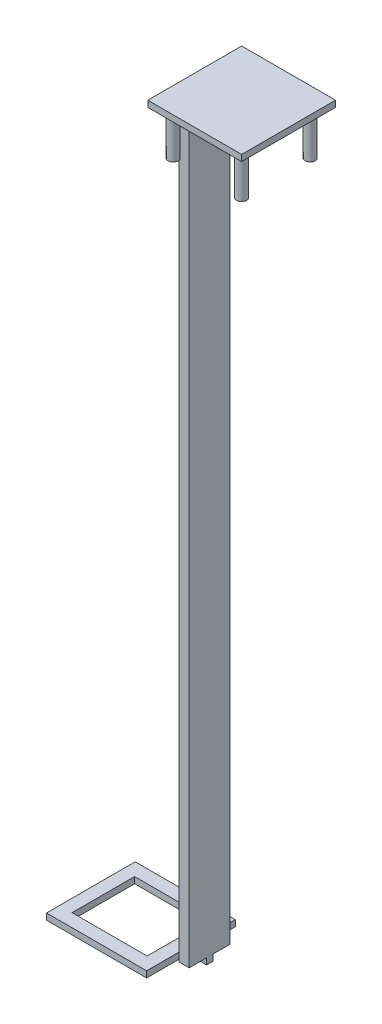
ISO-10303-21;
HEADER;
FILE_DESCRIPTION(('STEP AP214'),'2;1');
FILE_NAME('part.step','',(''),(''),'','','');
FILE_SCHEMA(('AUTOMOTIVE_DESIGN { 1 0 10303 214 1 1 1 1 }'));
ENDSEC;
DATA;
#1=APPLICATION_CONTEXT('core data for automotive mechanical design processes');
#2=APPLICATION_PROTOCOL_DEFINITION('international standard','automotive_design',2000,#1);
#3=PRODUCT_CONTEXT('',#1,'mechanical');
#4=PRODUCT('Part','Part','',(#3));
#5=PRODUCT_RELATED_PRODUCT_CATEGORY('part','',(#4));
#6=PRODUCT_DEFINITION_FORMATION('','',#4);
#7=PRODUCT_DEFINITION_CONTEXT('part definition',#1,'design');
#8=PRODUCT_DEFINITION('design','',#6,#7);
#9=PRODUCT_DEFINITION_SHAPE('','',#8);
#10=(LENGTH_UNIT() NAMED_UNIT(*) SI_UNIT(.MILLI.,.METRE.));
#11=(NAMED_UNIT(*) PLANE_ANGLE_UNIT() SI_UNIT($,.RADIAN.));
#12=(NAMED_UNIT(*) SI_UNIT($,.STERADIAN.) SOLID_ANGLE_UNIT());
#13=UNCERTAINTY_MEASURE_WITH_UNIT(LENGTH_MEASURE(1.E-05),#10,'distance_accuracy_value','');
#14=(GEOMETRIC_REPRESENTATION_CONTEXT(3) GLOBAL_UNCERTAINTY_ASSIGNED_CONTEXT((#13)) GLOBAL_UNIT_ASSIGNED_CONTEXT((#10,
#11,#12)) REPRESENTATION_CONTEXT('',''));
#15=CARTESIAN_POINT('',(0.,0.,0.));
#16=DIRECTION('',(0.,0.,1.));
#17=DIRECTION('',(1.,0.,0.));
#18=AXIS2_PLACEMENT_3D('',#15,#16,#17);
#19=CARTESIAN_POINT('',(0.,0.,0.));
#20=DIRECTION('',(0.,-1.,0.));
#21=DIRECTION('',(0.,0.,-1.));
#22=AXIS2_PLACEMENT_3D('',#19,#20,#21);
#23=PLANE('',#22);
#24=DIRECTION('',(-1.,0.,0.));
#25=VECTOR('',#24,1.);
#26=CARTESIAN_POINT('',(2.17170000004307,0.,-3.52939349999992));
#27=LINE('',#26,#25);
#28=CARTESIAN_POINT('',(2.17170000004307,0.,-3.52939349999992));
#29=VERTEX_POINT('',#28);
#30=CARTESIAN_POINT('',(-0.876299999956932,0.,-3.52939349999992));
#31=VERTEX_POINT('',#30);
#32=EDGE_CURVE('E297',#29,#31,#27,.T.);
#33=ORIENTED_EDGE('',*,*,#32,.F.);
#34=DIRECTION('',(0.,0.,-1.));
#35=VECTOR('',#34,1.);
#36=CARTESIAN_POINT('',(2.17170000004307,0.,-8.32878699999992));
#37=LINE('',#36,#35);
#38=CARTESIAN_POINT('',(2.17170000004307,0.,0.));
#39=VERTEX_POINT('',#38);
#40=EDGE_CURVE('E449',#39,#29,#37,.T.);
#41=ORIENTED_EDGE('',*,*,#40,.F.);
#42=DIRECTION('',(1.,0.,0.));
#43=VECTOR('',#42,1.);
#44=CARTESIAN_POINT('',(2.17170000004307,0.,0.));
#45=LINE('',#44,#43);
#46=CARTESIAN_POINT('',(0.139700000043068,0.,0.));
#47=VERTEX_POINT('',#46);
#48=EDGE_CURVE('E445',#47,#39,#45,.T.);
#49=ORIENTED_EDGE('',*,*,#48,.F.);
#50=DIRECTION('',(0.,0.,1.));
#51=VECTOR('',#50,1.);
#52=CARTESIAN_POINT('',(0.139700000043068,0.,0.));
#53=LINE('',#52,#51);
#54=CARTESIAN_POINT('',(0.139700000043068,0.,-1.30530599999992));
#55=VERTEX_POINT('',#54);
#56=EDGE_CURVE('E442',#55,#47,#53,.T.);
#57=ORIENTED_EDGE('',*,*,#56,.F.);
#58=DIRECTION('',(1.,0.,0.));
#59=VECTOR('',#58,1.);
#60=CARTESIAN_POINT('',(0.139700000043068,0.,-1.30530599999992));
#61=LINE('',#60,#59);
#62=CARTESIAN_POINT('',(-0.876299999956932,0.,-1.30530599999992));
#63=VERTEX_POINT('',#62);
#64=EDGE_CURVE('E438',#63,#55,#61,.T.);
#65=ORIENTED_EDGE('',*,*,#64,.F.);
#66=DIRECTION('',(0.,0.,1.));
#67=VECTOR('',#66,1.);
#68=CARTESIAN_POINT('',(-0.876299999956932,0.,-1.30530599999992));
#69=LINE('',#68,#67);
#70=EDGE_CURVE('E433',#31,#63,#69,.T.);
#71=ORIENTED_EDGE('',*,*,#70,.F.);
#72=EDGE_LOOP('',(#33,#41,#49,#57,#65,#71));
#73=FACE_BOUND('',#72,.T.);
#74=ADVANCED_FACE('F39',(#73),#23,.T.);
#75=CARTESIAN_POINT('',(0.139700000043068,152.4,-7.02348099999992));
#76=DIRECTION('',(1.,0.,0.));
#77=DIRECTION('',(0.,0.,-1.));
#78=AXIS2_PLACEMENT_3D('',#75,#76,#77);
#79=PLANE('',#78);
#80=DIRECTION('',(0.,0.,1.));
#81=VECTOR('',#80,1.);
#82=CARTESIAN_POINT('',(0.139700000043068,0.,-7.02348099999992));
#83=LINE('',#82,#81);
#84=CARTESIAN_POINT('',(0.139700000043068,0.,-8.32878699999992));
#85=VERTEX_POINT('',#84);
#86=CARTESIAN_POINT('',(0.139700000043068,0.,-7.02348099999992));
#87=VERTEX_POINT('',#86);
#88=EDGE_CURVE('E396',#85,#87,#83,.T.);
#89=ORIENTED_EDGE('',*,*,#88,.T.);
#90=DIRECTION('',(0.,-1.,0.));
#91=VECTOR('',#90,1.);
#92=CARTESIAN_POINT('',(0.139700000043068,152.4,-7.02348099999992));
#93=LINE('',#92,#91);
#94=CARTESIAN_POINT('',(0.139700000043068,152.4,-7.02348099999992));
#95=VERTEX_POINT('',#94);
#96=EDGE_CURVE('E482',#95,#87,#93,.T.);
#97=ORIENTED_EDGE('',*,*,#96,.F.);
#98=DIRECTION('',(0.,0.,1.));
#99=VECTOR('',#98,1.);
#100=CARTESIAN_POINT('',(0.139700000043068,152.4,-7.02348099999992));
#101=LINE('',#100,#99);
#102=CARTESIAN_POINT('',(0.139700000043068,152.4,-8.32878699999992));
#103=VERTEX_POINT('',#102);
#104=EDGE_CURVE('E397',#103,#95,#101,.T.);
#105=ORIENTED_EDGE('',*,*,#104,.F.);
#106=DIRECTION('',(0.,-1.,0.));
#107=VECTOR('',#106,1.);
#108=CARTESIAN_POINT('',(0.139700000043068,152.4,-8.32878699999992));
#109=LINE('',#108,#107);
#110=EDGE_CURVE('E426',#103,#85,#109,.T.);
#111=ORIENTED_EDGE('',*,*,#110,.T.);
#112=EDGE_LOOP('',(#89,#97,#105,#111));
#113=FACE_BOUND('',#112,.T.);
#114=ADVANCED_FACE('F41',(#113),#79,.F.);
#115=CARTESIAN_POINT('',(0.139700000043068,152.4,-7.02348099999992));
#116=DIRECTION('',(0.,0.,1.));
#117=DIRECTION('',(1.,0.,0.));
#118=AXIS2_PLACEMENT_3D('',#115,#116,#117);
#119=PLANE('',#118);
#120=DIRECTION('',(-1.,0.,0.));
#121=VECTOR('',#120,1.);
#122=CARTESIAN_POINT('',(0.139700000043068,0.,-7.02348099999992));
#123=LINE('',#122,#121);
#124=CARTESIAN_POINT('',(-0.876299999956932,0.,-7.02348099999992));
#125=VERTEX_POINT('',#124);
#126=EDGE_CURVE('E430',#87,#125,#123,.T.);
#127=ORIENTED_EDGE('',*,*,#126,.T.);
#128=DIRECTION('',(0.,-1.,0.));
#129=VECTOR('',#128,1.);
#130=CARTESIAN_POINT('',(-0.876299999956932,152.4,-7.02348099999992));
#131=LINE('',#130,#129);
#132=CARTESIAN_POINT('',(-0.876299999956932,152.4,-7.02348099999992));
#133=VERTEX_POINT('',#132);
#134=EDGE_CURVE('E478',#133,#125,#131,.T.);
#135=ORIENTED_EDGE('',*,*,#134,.F.);
#136=DIRECTION('',(-1.,0.,0.));
#137=VECTOR('',#136,1.);
#138=CARTESIAN_POINT('',(0.139700000043068,152.4,-7.02348099999992));
#139=LINE('',#138,#137);
#140=EDGE_CURVE('E401',#95,#133,#139,.T.);
#141=ORIENTED_EDGE('',*,*,#140,.F.);
#142=ORIENTED_EDGE('',*,*,#96,.T.);
#143=EDGE_LOOP('',(#127,#135,#141,#142));
#144=FACE_BOUND('',#143,.T.);
#145=ADVANCED_FACE('F527',(#144),#119,.F.);
#146=CARTESIAN_POINT('',(-0.876299999956932,152.4,-1.30530599999992));
#147=DIRECTION('',(1.,0.,0.));
#148=DIRECTION('',(0.,0.,-1.));
#149=AXIS2_PLACEMENT_3D('',#146,#147,#148);
#150=PLANE('',#149);
#151=CARTESIAN_POINT('',(-0.876299999956932,0.,-4.79939349999992));
#152=VERTEX_POINT('',#151);
#153=EDGE_CURVE('E434',#125,#152,#69,.T.);
#154=ORIENTED_EDGE('',*,*,#153,.T.);
#155=EDGE_CURVE('E439',#152,#31,#69,.T.);
#156=ORIENTED_EDGE('',*,*,#155,.T.);
#157=ORIENTED_EDGE('',*,*,#70,.T.);
#158=DIRECTION('',(0.,-1.,0.));
#159=VECTOR('',#158,1.);
#160=CARTESIAN_POINT('',(-0.876299999956932,152.4,-1.30530599999992));
#161=LINE('',#160,#159);
#162=CARTESIAN_POINT('',(-0.876299999956932,152.4,-1.30530599999992));
#163=VERTEX_POINT('',#162);
#164=EDGE_CURVE('E474',#163,#63,#161,.T.);
#165=ORIENTED_EDGE('',*,*,#164,.F.);
#166=DIRECTION('',(0.,0.,1.));
#167=VECTOR('',#166,1.);
#168=CARTESIAN_POINT('',(-0.876299999956933,152.4,-13.6893934999999));
#169=LINE('',#168,#167);
#170=CARTESIAN_POINT('',(-0.876299999956932,152.4,5.36060650000008));
#171=VERTEX_POINT('',#170);
#172=EDGE_CURVE('E353',#163,#171,#169,.T.);
#173=ORIENTED_EDGE('',*,*,#172,.T.);
#174=DIRECTION('',(0.,-1.,0.));
#175=VECTOR('',#174,1.);
#176=CARTESIAN_POINT('',(-0.876299999956932,153.67,5.36060650000008));
#177=LINE('',#176,#175);
#178=CARTESIAN_POINT('',(-0.876299999956932,153.67,5.36060650000008));
#179=VERTEX_POINT('',#178);
#180=EDGE_CURVE('E392',#179,#171,#177,.T.);
#181=ORIENTED_EDGE('',*,*,#180,.F.);
#182=DIRECTION('',(0.,0.,1.));
#183=VECTOR('',#182,1.);
#184=CARTESIAN_POINT('',(-0.876299999956933,153.67,-13.6893934999999));
#185=LINE('',#184,#183);
#186=CARTESIAN_POINT('',(-0.876299999956933,153.67,-13.6893934999999));
#187=VERTEX_POINT('',#186);
#188=EDGE_CURVE('E354',#187,#179,#185,.T.);
#189=ORIENTED_EDGE('',*,*,#188,.F.);
#190=DIRECTION('',(0.,-1.,0.));
#191=VECTOR('',#190,1.);
#192=CARTESIAN_POINT('',(-0.876299999956933,153.67,-13.6893934999999));
#193=LINE('',#192,#191);
#194=CARTESIAN_POINT('',(-0.876299999956933,152.4,-13.6893934999999));
#195=VERTEX_POINT('',#194);
#196=EDGE_CURVE('E368',#187,#195,#193,.T.);
#197=ORIENTED_EDGE('',*,*,#196,.T.);
#198=EDGE_CURVE('E369',#195,#133,#169,.T.);
#199=ORIENTED_EDGE('',*,*,#198,.T.);
#200=ORIENTED_EDGE('',*,*,#134,.T.);
#201=EDGE_LOOP('',(#154,#156,#157,#165,#173,#181,#189,#197,#199,#200));
#202=FACE_BOUND('',#201,.T.);
#203=ADVANCED_FACE('F529',(#202),#150,.F.);
#204=CARTESIAN_POINT('',(0.139700000043068,152.4,-1.30530599999992));
#205=DIRECTION('',(0.,0.,-1.));
#206=DIRECTION('',(-1.,0.,0.));
#207=AXIS2_PLACEMENT_3D('',#204,#205,#206);
#208=PLANE('',#207);
#209=ORIENTED_EDGE('',*,*,#64,.T.);
#210=DIRECTION('',(0.,-1.,0.));
#211=VECTOR('',#210,1.);
#212=CARTESIAN_POINT('',(0.139700000043068,152.4,-1.30530599999992));
#213=LINE('',#212,#211);
#214=CARTESIAN_POINT('',(0.139700000043068,152.4,-1.30530599999992));
#215=VERTEX_POINT('',#214);
#216=EDGE_CURVE('E470',#215,#55,#213,.T.);
#217=ORIENTED_EDGE('',*,*,#216,.F.);
#218=DIRECTION('',(1.,0.,0.));
#219=VECTOR('',#218,1.);
#220=CARTESIAN_POINT('',(0.139700000043068,152.4,-1.30530599999992));
#221=LINE('',#220,#219);
#222=EDGE_CURVE('E406',#163,#215,#221,.T.);
#223=ORIENTED_EDGE('',*,*,#222,.F.);
#224=ORIENTED_EDGE('',*,*,#164,.T.);
#225=EDGE_LOOP('',(#209,#217,#223,#224));
#226=FACE_BOUND('',#225,.T.);
#227=ADVANCED_FACE('F631',(#226),#208,.F.);
#228=CARTESIAN_POINT('',(0.139700000043068,152.4,0.));
#229=DIRECTION('',(1.,0.,0.));
#230=DIRECTION('',(0.,0.,-1.));
#231=AXIS2_PLACEMENT_3D('',#228,#229,#230);
#232=PLANE('',#231);
#233=ORIENTED_EDGE('',*,*,#56,.T.);
#234=DIRECTION('',(0.,-1.,0.));
#235=VECTOR('',#234,1.);
#236=CARTESIAN_POINT('',(0.139700000043068,152.4,0.));
#237=LINE('',#236,#235);
#238=CARTESIAN_POINT('',(0.139700000043068,152.4,0.));
#239=VERTEX_POINT('',#238);
#240=EDGE_CURVE('E466',#239,#47,#237,.T.);
#241=ORIENTED_EDGE('',*,*,#240,.F.);
#242=DIRECTION('',(0.,0.,1.));
#243=VECTOR('',#242,1.);
#244=CARTESIAN_POINT('',(0.139700000043068,152.4,0.));
#245=LINE('',#244,#243);
#246=EDGE_CURVE('E410',#215,#239,#245,.T.);
#247=ORIENTED_EDGE('',*,*,#246,.F.);
#248=ORIENTED_EDGE('',*,*,#216,.T.);
#249=EDGE_LOOP('',(#233,#241,#247,#248));
#250=FACE_BOUND('',#249,.T.);
#251=ADVANCED_FACE('F627',(#250),#232,.F.);
#252=CARTESIAN_POINT('',(2.17170000004307,152.4,0.));
#253=DIRECTION('',(0.,0.,-1.));
#254=DIRECTION('',(-1.,0.,0.));
#255=AXIS2_PLACEMENT_3D('',#252,#253,#254);
#256=PLANE('',#255);
#257=ORIENTED_EDGE('',*,*,#48,.T.);
#258=DIRECTION('',(0.,-1.,0.));
#259=VECTOR('',#258,1.);
#260=CARTESIAN_POINT('',(2.17170000004307,152.4,0.));
#261=LINE('',#260,#259);
#262=CARTESIAN_POINT('',(2.17170000004307,152.4,0.));
#263=VERTEX_POINT('',#262);
#264=EDGE_CURVE('E462',#263,#39,#261,.T.);
#265=ORIENTED_EDGE('',*,*,#264,.F.);
#266=DIRECTION('',(1.,0.,0.));
#267=VECTOR('',#266,1.);
#268=CARTESIAN_POINT('',(2.17170000004307,152.4,0.));
#269=LINE('',#268,#267);
#270=EDGE_CURVE('E414',#239,#263,#269,.T.);
#271=ORIENTED_EDGE('',*,*,#270,.F.);
#272=ORIENTED_EDGE('',*,*,#240,.T.);
#273=EDGE_LOOP('',(#257,#265,#271,#272));
#274=FACE_BOUND('',#273,.T.);
#275=ADVANCED_FACE('F622',(#274),#256,.F.);
#276=CARTESIAN_POINT('',(2.17170000004307,152.4,-8.32878699999992));
#277=DIRECTION('',(-1.,0.,0.));
#278=DIRECTION('',(0.,0.,1.));
#279=AXIS2_PLACEMENT_3D('',#276,#277,#278);
#280=PLANE('',#279);
#281=ORIENTED_EDGE('',*,*,#40,.T.);
#282=DIRECTION('',(0.,1.,0.));
#283=VECTOR('',#282,1.);
#284=CARTESIAN_POINT('',(2.17170000004307,-1.27,-3.52939349999992));
#285=LINE('',#284,#283);
#286=CARTESIAN_POINT('',(2.17170000004307,-1.27,-3.52939349999992));
#287=VERTEX_POINT('',#286);
#288=EDGE_CURVE('E317',#287,#29,#285,.T.);
#289=ORIENTED_EDGE('',*,*,#288,.F.);
#290=DIRECTION('',(0.,0.,1.));
#291=VECTOR('',#290,1.);
#292=CARTESIAN_POINT('',(2.17170000004307,-1.27,-3.52939349999992));
#293=LINE('',#292,#291);
#294=CARTESIAN_POINT('',(2.17170000004307,-1.27,-4.79939349999993));
#295=VERTEX_POINT('',#294);
#296=EDGE_CURVE('E272',#295,#287,#293,.T.);
#297=ORIENTED_EDGE('',*,*,#296,.F.);
#298=DIRECTION('',(0.,1.,0.));
#299=VECTOR('',#298,1.);
#300=CARTESIAN_POINT('',(2.17170000004307,-1.27,-4.79939349999993));
#301=LINE('',#300,#299);
#302=CARTESIAN_POINT('',(2.17170000004307,0.,-4.79939349999993));
#303=VERTEX_POINT('',#302);
#304=EDGE_CURVE('E321',#295,#303,#301,.T.);
#305=ORIENTED_EDGE('',*,*,#304,.T.);
#306=CARTESIAN_POINT('',(2.17170000004307,0.,-8.32878699999992));
#307=VERTEX_POINT('',#306);
#308=EDGE_CURVE('E448',#303,#307,#37,.T.);
#309=ORIENTED_EDGE('',*,*,#308,.T.);
#310=DIRECTION('',(0.,-1.,0.));
#311=VECTOR('',#310,1.);
#312=CARTESIAN_POINT('',(2.17170000004307,152.4,-8.32878699999992));
#313=LINE('',#312,#311);
#314=CARTESIAN_POINT('',(2.17170000004307,152.4,-8.32878699999992));
#315=VERTEX_POINT('',#314);
#316=EDGE_CURVE('E458',#315,#307,#313,.T.);
#317=ORIENTED_EDGE('',*,*,#316,.F.);
#318=DIRECTION('',(0.,0.,-1.));
#319=VECTOR('',#318,1.);
#320=CARTESIAN_POINT('',(2.17170000004307,152.4,-8.32878699999992));
#321=LINE('',#320,#319);
#322=EDGE_CURVE('E418',#263,#315,#321,.T.);
#323=ORIENTED_EDGE('',*,*,#322,.F.);
#324=ORIENTED_EDGE('',*,*,#264,.T.);
#325=EDGE_LOOP('',(#281,#289,#297,#305,#309,#317,#323,#324));
#326=FACE_BOUND('',#325,.T.);
#327=ADVANCED_FACE('F577',(#326),#280,.F.);
#328=CARTESIAN_POINT('',(0.139700000043068,152.4,-8.32878699999992));
#329=DIRECTION('',(0.,0.,1.));
#330=DIRECTION('',(1.,0.,0.));
#331=AXIS2_PLACEMENT_3D('',#328,#329,#330);
#332=PLANE('',#331);
#333=DIRECTION('',(-1.,0.,0.));
#334=VECTOR('',#333,1.);
#335=CARTESIAN_POINT('',(0.139700000043068,0.,-8.32878699999992));
#336=LINE('',#335,#334);
#337=EDGE_CURVE('E402',#307,#85,#336,.T.);
#338=ORIENTED_EDGE('',*,*,#337,.T.);
#339=ORIENTED_EDGE('',*,*,#110,.F.);
#340=DIRECTION('',(-1.,0.,0.));
#341=VECTOR('',#340,1.);
#342=CARTESIAN_POINT('',(0.139700000043068,152.4,-8.32878699999992));
#343=LINE('',#342,#341);
#344=EDGE_CURVE('E422',#315,#103,#343,.T.);
#345=ORIENTED_EDGE('',*,*,#344,.F.);
#346=ORIENTED_EDGE('',*,*,#316,.T.);
#347=EDGE_LOOP('',(#338,#339,#345,#346));
#348=FACE_BOUND('',#347,.T.);
#349=ADVANCED_FACE('F522',(#348),#332,.F.);
#350=DIRECTION('',(1.,0.,0.));
#351=VECTOR('',#350,1.);
#352=CARTESIAN_POINT('',(2.17170000004307,0.,-4.79939349999993));
#353=LINE('',#352,#351);
#354=EDGE_CURVE('E11',#152,#303,#353,.T.);
#355=ORIENTED_EDGE('',*,*,#354,.F.);
#356=ORIENTED_EDGE('',*,*,#153,.F.);
#357=ORIENTED_EDGE('',*,*,#126,.F.);
#358=ORIENTED_EDGE('',*,*,#88,.F.);
#359=ORIENTED_EDGE('',*,*,#337,.F.);
#360=ORIENTED_EDGE('',*,*,#308,.F.);
#361=EDGE_LOOP('',(#355,#356,#357,#358,#359,#360));
#362=FACE_BOUND('',#361,.T.);
#363=ADVANCED_FACE('F508',(#362),#23,.T.);
#364=CARTESIAN_POINT('',(0.,152.4,0.));
#365=DIRECTION('',(0.,1.,0.));
#366=DIRECTION('',(0.,0.,1.));
#367=AXIS2_PLACEMENT_3D('',#364,#365,#366);
#368=PLANE('',#367);
#369=CARTESIAN_POINT('',(1.69456593496488,152.4,2.78974056507817));
#370=DIRECTION('',(0.,1.,0.));
#371=DIRECTION('',(0.,0.,1.));
#372=AXIS2_PLACEMENT_3D('',#369,#370,#371);
#373=CIRCLE('',#372,1.016);
#374=CARTESIAN_POINT('',(1.69456593496488,152.4,3.80574056507816));
#375=VERTEX_POINT('',#374);
#376=EDGE_CURVE('E43',#375,#375,#373,.F.);
#377=ORIENTED_EDGE('',*,*,#376,.F.);
#378=EDGE_LOOP('',(#377));
#379=FACE_BOUND('',#378,.T.);
#380=CARTESIAN_POINT('',(1.69456593496487,152.4,-11.118527565078));
#381=DIRECTION('',(0.,1.,0.));
#382=DIRECTION('',(0.,0.,1.));
#383=AXIS2_PLACEMENT_3D('',#380,#381,#382);
#384=CIRCLE('',#383,1.016);
#385=CARTESIAN_POINT('',(1.69456593496487,152.4,-10.102527565078));
#386=VERTEX_POINT('',#385);
#387=EDGE_CURVE('E493',#386,#386,#384,.F.);
#388=ORIENTED_EDGE('',*,*,#387,.F.);
#389=EDGE_LOOP('',(#388));
#390=FACE_BOUND('',#389,.T.);
#391=CARTESIAN_POINT('',(15.6028340651212,152.4,-11.118527565078));
#392=DIRECTION('',(0.,1.,0.));
#393=DIRECTION('',(0.,0.,1.));
#394=AXIS2_PLACEMENT_3D('',#391,#392,#393);
#395=CIRCLE('',#394,1.016);
#396=CARTESIAN_POINT('',(15.6028340651212,152.4,-10.102527565078));
#397=VERTEX_POINT('',#396);
#398=EDGE_CURVE('E490',#397,#397,#395,.F.);
#399=ORIENTED_EDGE('',*,*,#398,.F.);
#400=EDGE_LOOP('',(#399));
#401=FACE_BOUND('',#400,.T.);
#402=CARTESIAN_POINT('',(15.6028340651212,152.4,2.78974056507818));
#403=DIRECTION('',(0.,1.,0.));
#404=DIRECTION('',(0.,0.,1.));
#405=AXIS2_PLACEMENT_3D('',#402,#403,#404);
#406=CIRCLE('',#405,1.016);
#407=CARTESIAN_POINT('',(15.6028340651212,152.4,3.80574056507818));
#408=VERTEX_POINT('',#407);
#409=EDGE_CURVE('E486',#408,#408,#406,.F.);
#410=ORIENTED_EDGE('',*,*,#409,.F.);
#411=EDGE_LOOP('',(#410));
#412=FACE_BOUND('',#411,.T.);
#413=ORIENTED_EDGE('',*,*,#104,.T.);
#414=ORIENTED_EDGE('',*,*,#140,.T.);
#415=ORIENTED_EDGE('',*,*,#198,.F.);
#416=DIRECTION('',(-1.,0.,0.));
#417=VECTOR('',#416,1.);
#418=CARTESIAN_POINT('',(-0.876299999956933,152.4,-13.6893934999999));
#419=LINE('',#418,#417);
#420=CARTESIAN_POINT('',(18.173700000043,152.4,-13.6893934999999));
#421=VERTEX_POINT('',#420);
#422=EDGE_CURVE('E359',#421,#195,#419,.T.);
#423=ORIENTED_EDGE('',*,*,#422,.F.);
#424=DIRECTION('',(0.,0.,-1.));
#425=VECTOR('',#424,1.);
#426=CARTESIAN_POINT('',(18.173700000043,152.4,-13.6893934999999));
#427=LINE('',#426,#425);
#428=CARTESIAN_POINT('',(18.173700000043,152.4,5.36060650000008));
#429=VERTEX_POINT('',#428);
#430=EDGE_CURVE('E376',#429,#421,#427,.T.);
#431=ORIENTED_EDGE('',*,*,#430,.F.);
#432=DIRECTION('',(1.,0.,0.));
#433=VECTOR('',#432,1.);
#434=CARTESIAN_POINT('',(-0.876299999956932,152.4,5.36060650000008));
#435=LINE('',#434,#433);
#436=EDGE_CURVE('E373',#171,#429,#435,.T.);
#437=ORIENTED_EDGE('',*,*,#436,.F.);
#438=ORIENTED_EDGE('',*,*,#172,.F.);
#439=ORIENTED_EDGE('',*,*,#222,.T.);
#440=ORIENTED_EDGE('',*,*,#246,.T.);
#441=ORIENTED_EDGE('',*,*,#270,.T.);
#442=ORIENTED_EDGE('',*,*,#322,.T.);
#443=ORIENTED_EDGE('',*,*,#344,.T.);
#444=EDGE_LOOP('',(#413,#414,#415,#423,#431,#437,#438,#439,#440,#441,#442,#443));
#445=FACE_BOUND('',#444,.T.);
#446=ADVANCED_FACE('F504',(#379,#390,#401,#412,#445),#368,.F.);
#447=CARTESIAN_POINT('',(-0.876299999956932,153.67,5.36060650000008));
#448=DIRECTION('',(0.,0.,-1.));
#449=DIRECTION('',(-1.,0.,0.));
#450=AXIS2_PLACEMENT_3D('',#447,#448,#449);
#451=PLANE('',#450);
#452=ORIENTED_EDGE('',*,*,#436,.T.);
#453=DIRECTION('',(0.,-1.,0.));
#454=VECTOR('',#453,1.);
#455=CARTESIAN_POINT('',(18.173700000043,153.67,5.36060650000008));
#456=LINE('',#455,#454);
#457=CARTESIAN_POINT('',(18.173700000043,153.67,5.36060650000008));
#458=VERTEX_POINT('',#457);
#459=EDGE_CURVE('E388',#458,#429,#456,.T.);
#460=ORIENTED_EDGE('',*,*,#459,.F.);
#461=DIRECTION('',(1.,0.,0.));
#462=VECTOR('',#461,1.);
#463=CARTESIAN_POINT('',(-0.876299999956932,153.67,5.36060650000008));
#464=LINE('',#463,#462);
#465=EDGE_CURVE('E358',#179,#458,#464,.T.);
#466=ORIENTED_EDGE('',*,*,#465,.F.);
#467=ORIENTED_EDGE('',*,*,#180,.T.);
#468=EDGE_LOOP('',(#452,#460,#466,#467));
#469=FACE_BOUND('',#468,.T.);
#470=ADVANCED_FACE('F507',(#469),#451,.F.);
#471=CARTESIAN_POINT('',(18.173700000043,153.67,-13.6893934999999));
#472=DIRECTION('',(-1.,0.,0.));
#473=DIRECTION('',(0.,0.,1.));
#474=AXIS2_PLACEMENT_3D('',#471,#472,#473);
#475=PLANE('',#474);
#476=ORIENTED_EDGE('',*,*,#430,.T.);
#477=DIRECTION('',(0.,-1.,0.));
#478=VECTOR('',#477,1.);
#479=CARTESIAN_POINT('',(18.173700000043,153.67,-13.6893934999999));
#480=LINE('',#479,#478);
#481=CARTESIAN_POINT('',(18.173700000043,153.67,-13.6893934999999));
#482=VERTEX_POINT('',#481);
#483=EDGE_CURVE('E384',#482,#421,#480,.T.);
#484=ORIENTED_EDGE('',*,*,#483,.F.);
#485=DIRECTION('',(0.,0.,-1.));
#486=VECTOR('',#485,1.);
#487=CARTESIAN_POINT('',(18.173700000043,153.67,-13.6893934999999));
#488=LINE('',#487,#486);
#489=EDGE_CURVE('E362',#458,#482,#488,.T.);
#490=ORIENTED_EDGE('',*,*,#489,.F.);
#491=ORIENTED_EDGE('',*,*,#459,.T.);
#492=EDGE_LOOP('',(#476,#484,#490,#491));
#493=FACE_BOUND('',#492,.T.);
#494=ADVANCED_FACE('F543',(#493),#475,.F.);
#495=CARTESIAN_POINT('',(-0.876299999956933,153.67,-13.6893934999999));
#496=DIRECTION('',(0.,0.,1.));
#497=DIRECTION('',(1.,0.,0.));
#498=AXIS2_PLACEMENT_3D('',#495,#496,#497);
#499=PLANE('',#498);
#500=ORIENTED_EDGE('',*,*,#422,.T.);
#501=ORIENTED_EDGE('',*,*,#196,.F.);
#502=DIRECTION('',(-1.,0.,0.));
#503=VECTOR('',#502,1.);
#504=CARTESIAN_POINT('',(-0.876299999956933,153.67,-13.6893934999999));
#505=LINE('',#504,#503);
#506=EDGE_CURVE('E365',#482,#187,#505,.T.);
#507=ORIENTED_EDGE('',*,*,#506,.F.);
#508=ORIENTED_EDGE('',*,*,#483,.T.);
#509=EDGE_LOOP('',(#500,#501,#507,#508));
#510=FACE_BOUND('',#509,.T.);
#511=ADVANCED_FACE('F538',(#510),#499,.F.);
#512=CARTESIAN_POINT('',(0.,153.67,0.));
#513=DIRECTION('',(0.,1.,0.));
#514=DIRECTION('',(0.,0.,1.));
#515=AXIS2_PLACEMENT_3D('',#512,#513,#514);
#516=PLANE('',#515);
#517=ORIENTED_EDGE('',*,*,#188,.T.);
#518=ORIENTED_EDGE('',*,*,#465,.T.);
#519=ORIENTED_EDGE('',*,*,#489,.T.);
#520=ORIENTED_EDGE('',*,*,#506,.T.);
#521=EDGE_LOOP('',(#517,#518,#519,#520));
#522=FACE_BOUND('',#521,.T.);
#523=ADVANCED_FACE('F834',(#522),#516,.T.);
#524=CARTESIAN_POINT('',(15.6028340651212,143.51,2.78974056507818));
#525=DIRECTION('',(0.,1.,0.));
#526=DIRECTION('',(0.,0.,1.));
#527=AXIS2_PLACEMENT_3D('',#524,#525,#526);
#528=CYLINDRICAL_SURFACE('',#527,1.016);
#529=CARTESIAN_POINT('',(15.6028340651212,143.51,2.78974056507818));
#530=DIRECTION('',(0.,-1.,0.));
#531=DIRECTION('',(0.,0.,-1.));
#532=AXIS2_PLACEMENT_3D('',#529,#530,#531);
#533=CIRCLE('',#532,1.016);
#534=CARTESIAN_POINT('',(15.6028340651212,143.51,1.77374056507818));
#535=VERTEX_POINT('',#534);
#536=EDGE_CURVE('E349',#535,#535,#533,.T.);
#537=ORIENTED_EDGE('',*,*,#536,.F.);
#538=EDGE_LOOP('',(#537));
#539=FACE_BOUND('',#538,.T.);
#540=ORIENTED_EDGE('',*,*,#409,.T.);
#541=EDGE_LOOP('',(#540));
#542=FACE_BOUND('',#541,.T.);
#543=ADVANCED_FACE('F826',(#539,#542),#528,.T.);
#544=CARTESIAN_POINT('',(15.6028340651212,143.51,2.78974056507818));
#545=DIRECTION('',(0.,-1.,0.));
#546=DIRECTION('',(0.,0.,-1.));
#547=AXIS2_PLACEMENT_3D('',#544,#545,#546);
#548=PLANE('',#547);
#549=ORIENTED_EDGE('',*,*,#536,.T.);
#550=EDGE_LOOP('',(#549));
#551=FACE_BOUND('',#550,.T.);
#552=ADVANCED_FACE('F818',(#551),#548,.T.);
#553=CARTESIAN_POINT('',(15.6028340651212,143.51,-11.118527565078));
#554=DIRECTION('',(0.,1.,0.));
#555=DIRECTION('',(0.,0.,1.));
#556=AXIS2_PLACEMENT_3D('',#553,#554,#555);
#557=CYLINDRICAL_SURFACE('',#556,1.016);
#558=CARTESIAN_POINT('',(15.6028340651212,143.51,-11.118527565078));
#559=DIRECTION('',(0.,-1.,0.));
#560=DIRECTION('',(0.,0.,1.));
#561=AXIS2_PLACEMENT_3D('',#558,#559,#560);
#562=CIRCLE('',#561,1.016);
#563=CARTESIAN_POINT('',(15.6028340651212,143.51,-10.102527565078));
#564=VERTEX_POINT('',#563);
#565=EDGE_CURVE('E345',#564,#564,#562,.T.);
#566=ORIENTED_EDGE('',*,*,#565,.F.);
#567=EDGE_LOOP('',(#566));
#568=FACE_BOUND('',#567,.T.);
#569=ORIENTED_EDGE('',*,*,#398,.T.);
#570=EDGE_LOOP('',(#569));
#571=FACE_BOUND('',#570,.T.);
#572=ADVANCED_FACE('F810',(#568,#571),#557,.T.);
#573=CARTESIAN_POINT('',(15.6028340651212,143.51,-11.118527565078));
#574=DIRECTION('',(0.,1.,0.));
#575=DIRECTION('',(0.,0.,1.));
#576=AXIS2_PLACEMENT_3D('',#573,#574,#575);
#577=PLANE('',#576);
#578=ORIENTED_EDGE('',*,*,#565,.T.);
#579=EDGE_LOOP('',(#578));
#580=FACE_BOUND('',#579,.T.);
#581=ADVANCED_FACE('F802',(#580),#577,.F.);
#582=CARTESIAN_POINT('',(1.69456593496487,143.51,-11.118527565078));
#583=DIRECTION('',(0.,1.,0.));
#584=DIRECTION('',(0.,0.,1.));
#585=AXIS2_PLACEMENT_3D('',#582,#583,#584);
#586=CYLINDRICAL_SURFACE('',#585,1.016);
#587=CARTESIAN_POINT('',(1.69456593496487,143.51,-11.118527565078));
#588=DIRECTION('',(0.,-1.,0.));
#589=DIRECTION('',(0.,0.,-1.));
#590=AXIS2_PLACEMENT_3D('',#587,#588,#589);
#591=CIRCLE('',#590,1.016);
#592=CARTESIAN_POINT('',(1.69456593496487,143.51,-12.134527565078));
#593=VERTEX_POINT('',#592);
#594=EDGE_CURVE('E341',#593,#593,#591,.T.);
#595=ORIENTED_EDGE('',*,*,#594,.F.);
#596=EDGE_LOOP('',(#595));
#597=FACE_BOUND('',#596,.T.);
#598=ORIENTED_EDGE('',*,*,#387,.T.);
#599=EDGE_LOOP('',(#598));
#600=FACE_BOUND('',#599,.T.);
#601=ADVANCED_FACE('F794',(#597,#600),#586,.T.);
#602=CARTESIAN_POINT('',(1.69456593496487,143.51,-11.118527565078));
#603=DIRECTION('',(0.,-1.,0.));
#604=DIRECTION('',(0.,0.,-1.));
#605=AXIS2_PLACEMENT_3D('',#602,#603,#604);
#606=PLANE('',#605);
#607=ORIENTED_EDGE('',*,*,#594,.T.);
#608=EDGE_LOOP('',(#607));
#609=FACE_BOUND('',#608,.T.);
#610=ADVANCED_FACE('F786',(#609),#606,.T.);
#611=CARTESIAN_POINT('',(1.69456593496488,143.51,2.78974056507817));
#612=DIRECTION('',(0.,1.,0.));
#613=DIRECTION('',(0.,0.,1.));
#614=AXIS2_PLACEMENT_3D('',#611,#612,#613);
#615=CYLINDRICAL_SURFACE('',#614,1.016);
#616=CARTESIAN_POINT('',(1.69456593496488,143.51,2.78974056507817));
#617=DIRECTION('',(0.,-1.,0.));
#618=DIRECTION('',(0.,0.,1.));
#619=AXIS2_PLACEMENT_3D('',#616,#617,#618);
#620=CIRCLE('',#619,1.016);
#621=CARTESIAN_POINT('',(1.69456593496488,143.51,3.80574056507816));
#622=VERTEX_POINT('',#621);
#623=EDGE_CURVE('E337',#622,#622,#620,.T.);
#624=ORIENTED_EDGE('',*,*,#623,.F.);
#625=EDGE_LOOP('',(#624));
#626=FACE_BOUND('',#625,.T.);
#627=ORIENTED_EDGE('',*,*,#376,.T.);
#628=EDGE_LOOP('',(#627));
#629=FACE_BOUND('',#628,.T.);
#630=ADVANCED_FACE('F502',(#626,#629),#615,.T.);
#631=CARTESIAN_POINT('',(1.69456593496488,143.51,2.78974056507817));
#632=DIRECTION('',(0.,1.,0.));
#633=DIRECTION('',(0.,0.,1.));
#634=AXIS2_PLACEMENT_3D('',#631,#632,#633);
#635=PLANE('',#634);
#636=ORIENTED_EDGE('',*,*,#623,.T.);
#637=EDGE_LOOP('',(#636));
#638=FACE_BOUND('',#637,.T.);
#639=ADVANCED_FACE('F606',(#638),#635,.F.);
#640=CARTESIAN_POINT('',(-21.9582999999569,-1.27,4.83560650000008));
#641=DIRECTION('',(1.,0.,0.));
#642=DIRECTION('',(0.,0.,-1.));
#643=AXIS2_PLACEMENT_3D('',#640,#641,#642);
#644=PLANE('',#643);
#645=DIRECTION('',(0.,0.,-1.));
#646=VECTOR('',#645,1.);
#647=CARTESIAN_POINT('',(-21.9582999999569,0.,4.83560650000008));
#648=LINE('',#647,#646);
#649=CARTESIAN_POINT('',(-21.9582999999569,0.,4.83560650000008));
#650=VERTEX_POINT('',#649);
#651=CARTESIAN_POINT('',(-21.9582999999569,0.,-13.1643934999999));
#652=VERTEX_POINT('',#651);
#653=EDGE_CURVE('E252',#650,#652,#648,.T.);
#654=ORIENTED_EDGE('',*,*,#653,.T.);
#655=DIRECTION('',(0.,1.,0.));
#656=VECTOR('',#655,1.);
#657=CARTESIAN_POINT('',(-21.9582999999569,-1.27,-13.1643934999999));
#658=LINE('',#657,#656);
#659=CARTESIAN_POINT('',(-21.9582999999569,-1.27,-13.1643934999999));
#660=VERTEX_POINT('',#659);
#661=EDGE_CURVE('E333',#660,#652,#658,.T.);
#662=ORIENTED_EDGE('',*,*,#661,.F.);
#663=DIRECTION('',(0.,0.,-1.));
#664=VECTOR('',#663,1.);
#665=CARTESIAN_POINT('',(-21.9582999999569,-1.27,4.83560650000008));
#666=LINE('',#665,#664);
#667=CARTESIAN_POINT('',(-21.9582999999569,-1.27,4.83560650000008));
#668=VERTEX_POINT('',#667);
#669=EDGE_CURVE('E258',#668,#660,#666,.T.);
#670=ORIENTED_EDGE('',*,*,#669,.F.);
#671=DIRECTION('',(0.,1.,0.));
#672=VECTOR('',#671,1.);
#673=CARTESIAN_POINT('',(-21.9582999999569,-1.27,4.83560650000008));
#674=LINE('',#673,#672);
#675=EDGE_CURVE('E284',#668,#650,#674,.T.);
#676=ORIENTED_EDGE('',*,*,#675,.T.);
#677=EDGE_LOOP('',(#654,#662,#670,#676));
#678=FACE_BOUND('',#677,.T.);
#679=ADVANCED_FACE('F571',(#678),#644,.F.);
#680=CARTESIAN_POINT('',(-21.9582999999569,-1.27,-13.1643934999999));
#681=DIRECTION('',(0.,0.,1.));
#682=DIRECTION('',(1.,0.,0.));
#683=AXIS2_PLACEMENT_3D('',#680,#681,#682);
#684=PLANE('',#683);
#685=DIRECTION('',(1.,0.,0.));
#686=VECTOR('',#685,1.);
#687=CARTESIAN_POINT('',(-21.9582999999569,0.,-13.1643934999999));
#688=LINE('',#687,#686);
#689=CARTESIAN_POINT('',(-1.63829999995696,0.,-13.1643934999999));
#690=VERTEX_POINT('',#689);
#691=EDGE_CURVE('E288',#652,#690,#688,.T.);
#692=ORIENTED_EDGE('',*,*,#691,.T.);
#693=DIRECTION('',(0.,1.,0.));
#694=VECTOR('',#693,1.);
#695=CARTESIAN_POINT('',(-1.63829999995696,-1.27,-13.1643934999999));
#696=LINE('',#695,#694);
#697=CARTESIAN_POINT('',(-1.63829999995696,-1.27,-13.1643934999999));
#698=VERTEX_POINT('',#697);
#699=EDGE_CURVE('E329',#698,#690,#696,.T.);
#700=ORIENTED_EDGE('',*,*,#699,.F.);
#701=DIRECTION('',(1.,0.,0.));
#702=VECTOR('',#701,1.);
#703=CARTESIAN_POINT('',(-21.9582999999569,-1.27,-13.1643934999999));
#704=LINE('',#703,#702);
#705=EDGE_CURVE('E262',#660,#698,#704,.T.);
#706=ORIENTED_EDGE('',*,*,#705,.F.);
#707=ORIENTED_EDGE('',*,*,#661,.T.);
#708=EDGE_LOOP('',(#692,#700,#706,#707));
#709=FACE_BOUND('',#708,.T.);
#710=ADVANCED_FACE('F598',(#709),#684,.F.);
#711=CARTESIAN_POINT('',(-1.63829999995693,-1.27,-4.79939349999992));
#712=DIRECTION('',(-1.,0.,0.));
#713=DIRECTION('',(0.,0.,1.));
#714=AXIS2_PLACEMENT_3D('',#711,#712,#713);
#715=PLANE('',#714);
#716=DIRECTION('',(0.,0.,1.));
#717=VECTOR('',#716,1.);
#718=CARTESIAN_POINT('',(-1.63829999995693,0.,-4.79939349999992));
#719=LINE('',#718,#717);
#720=CARTESIAN_POINT('',(-1.63829999995693,0.,-4.79939349999992));
#721=VERTEX_POINT('',#720);
#722=EDGE_CURVE('E291',#690,#721,#719,.T.);
#723=ORIENTED_EDGE('',*,*,#722,.T.);
#724=DIRECTION('',(0.,1.,0.));
#725=VECTOR('',#724,1.);
#726=CARTESIAN_POINT('',(-1.63829999995693,-1.27,-4.79939349999992));
#727=LINE('',#726,#725);
#728=CARTESIAN_POINT('',(-1.63829999995693,-1.27,-4.79939349999992));
#729=VERTEX_POINT('',#728);
#730=EDGE_CURVE('E325',#729,#721,#727,.T.);
#731=ORIENTED_EDGE('',*,*,#730,.F.);
#732=DIRECTION('',(0.,0.,1.));
#733=VECTOR('',#732,1.);
#734=CARTESIAN_POINT('',(-1.63829999995693,-1.27,-4.79939349999992));
#735=LINE('',#734,#733);
#736=EDGE_CURVE('E266',#698,#729,#735,.T.);
#737=ORIENTED_EDGE('',*,*,#736,.F.);
#738=ORIENTED_EDGE('',*,*,#699,.T.);
#739=EDGE_LOOP('',(#723,#731,#737,#738));
#740=FACE_BOUND('',#739,.T.);
#741=ADVANCED_FACE('F595',(#740),#715,.F.);
#742=CARTESIAN_POINT('',(2.17170000004307,-1.27,-4.79939349999993));
#743=DIRECTION('',(0.,0.,1.));
#744=DIRECTION('',(1.,0.,0.));
#745=AXIS2_PLACEMENT_3D('',#742,#743,#744);
#746=PLANE('',#745);
#747=EDGE_CURVE('E50',#721,#152,#353,.T.);
#748=ORIENTED_EDGE('',*,*,#747,.T.);
#749=ORIENTED_EDGE('',*,*,#354,.T.);
#750=ORIENTED_EDGE('',*,*,#304,.F.);
#751=DIRECTION('',(1.,0.,0.));
#752=VECTOR('',#751,1.);
#753=CARTESIAN_POINT('',(2.17170000004307,-1.27,-4.79939349999993));
#754=LINE('',#753,#752);
#755=EDGE_CURVE('E269',#729,#295,#754,.T.);
#756=ORIENTED_EDGE('',*,*,#755,.F.);
#757=ORIENTED_EDGE('',*,*,#730,.T.);
#758=EDGE_LOOP('',(#748,#749,#750,#756,#757));
#759=FACE_BOUND('',#758,.T.);
#760=ADVANCED_FACE('F591',(#759),#746,.F.);
#761=CARTESIAN_POINT('',(2.17170000004307,-1.27,-3.52939349999992));
#762=DIRECTION('',(0.,0.,-1.));
#763=DIRECTION('',(-1.,0.,0.));
#764=AXIS2_PLACEMENT_3D('',#761,#762,#763);
#765=PLANE('',#764);
#766=ORIENTED_EDGE('',*,*,#32,.T.);
#767=CARTESIAN_POINT('',(-1.63829999995693,0.,-3.52939349999992));
#768=VERTEX_POINT('',#767);
#769=EDGE_CURVE('E296',#31,#768,#27,.T.);
#770=ORIENTED_EDGE('',*,*,#769,.T.);
#771=DIRECTION('',(0.,1.,0.));
#772=VECTOR('',#771,1.);
#773=CARTESIAN_POINT('',(-1.63829999995693,-1.27,-3.52939349999992));
#774=LINE('',#773,#772);
#775=CARTESIAN_POINT('',(-1.63829999995693,-1.27,-3.52939349999992));
#776=VERTEX_POINT('',#775);
#777=EDGE_CURVE('E313',#776,#768,#774,.T.);
#778=ORIENTED_EDGE('',*,*,#777,.F.);
#779=DIRECTION('',(-1.,0.,0.));
#780=VECTOR('',#779,1.);
#781=CARTESIAN_POINT('',(2.17170000004307,-1.27,-3.52939349999992));
#782=LINE('',#781,#780);
#783=EDGE_CURVE('E275',#287,#776,#782,.T.);
#784=ORIENTED_EDGE('',*,*,#783,.F.);
#785=ORIENTED_EDGE('',*,*,#288,.T.);
#786=EDGE_LOOP('',(#766,#770,#778,#784,#785));
#787=FACE_BOUND('',#786,.T.);
#788=ADVANCED_FACE('F554',(#787),#765,.F.);
#789=CARTESIAN_POINT('',(-1.63829999995696,-1.27,4.83560650000008));
#790=DIRECTION('',(-1.,0.,0.));
#791=DIRECTION('',(0.,0.,1.));
#792=AXIS2_PLACEMENT_3D('',#789,#790,#791);
#793=PLANE('',#792);
#794=DIRECTION('',(0.,0.,1.));
#795=VECTOR('',#794,1.);
#796=CARTESIAN_POINT('',(-1.63829999995696,0.,4.83560650000008));
#797=LINE('',#796,#795);
#798=CARTESIAN_POINT('',(-1.63829999995696,0.,4.83560650000008));
#799=VERTEX_POINT('',#798);
#800=EDGE_CURVE('E301',#768,#799,#797,.T.);
#801=ORIENTED_EDGE('',*,*,#800,.T.);
#802=DIRECTION('',(0.,1.,0.));
#803=VECTOR('',#802,1.);
#804=CARTESIAN_POINT('',(-1.63829999995696,-1.27,4.83560650000008));
#805=LINE('',#804,#803);
#806=CARTESIAN_POINT('',(-1.63829999995696,-1.27,4.83560650000008));
#807=VERTEX_POINT('',#806);
#808=EDGE_CURVE('E309',#807,#799,#805,.T.);
#809=ORIENTED_EDGE('',*,*,#808,.F.);
#810=DIRECTION('',(0.,0.,1.));
#811=VECTOR('',#810,1.);
#812=CARTESIAN_POINT('',(-1.63829999995696,-1.27,4.83560650000008));
#813=LINE('',#812,#811);
#814=EDGE_CURVE('E278',#776,#807,#813,.T.);
#815=ORIENTED_EDGE('',*,*,#814,.F.);
#816=ORIENTED_EDGE('',*,*,#777,.T.);
#817=EDGE_LOOP('',(#801,#809,#815,#816));
#818=FACE_BOUND('',#817,.T.);
#819=ADVANCED_FACE('F560',(#818),#793,.F.);
#820=CARTESIAN_POINT('',(-21.9582999999569,-1.27,4.83560650000008));
#821=DIRECTION('',(0.,0.,-1.));
#822=DIRECTION('',(-1.,0.,0.));
#823=AXIS2_PLACEMENT_3D('',#820,#821,#822);
#824=PLANE('',#823);
#825=DIRECTION('',(-1.,0.,0.));
#826=VECTOR('',#825,1.);
#827=CARTESIAN_POINT('',(-21.9582999999569,0.,4.83560650000008));
#828=LINE('',#827,#826);
#829=EDGE_CURVE('E263',#799,#650,#828,.T.);
#830=ORIENTED_EDGE('',*,*,#829,.T.);
#831=ORIENTED_EDGE('',*,*,#675,.F.);
#832=DIRECTION('',(-1.,0.,0.));
#833=VECTOR('',#832,1.);
#834=CARTESIAN_POINT('',(-21.9582999999569,-1.27,4.83560650000008));
#835=LINE('',#834,#833);
#836=EDGE_CURVE('E281',#807,#668,#835,.T.);
#837=ORIENTED_EDGE('',*,*,#836,.F.);
#838=ORIENTED_EDGE('',*,*,#808,.T.);
#839=EDGE_LOOP('',(#830,#831,#837,#838));
#840=FACE_BOUND('',#839,.T.);
#841=ADVANCED_FACE('F567',(#840),#824,.F.);
#842=CARTESIAN_POINT('',(0.,-1.27,0.));
#843=DIRECTION('',(0.,-1.,0.));
#844=DIRECTION('',(0.,0.,-1.));
#845=AXIS2_PLACEMENT_3D('',#842,#843,#844);
#846=PLANE('',#845);
#847=DIRECTION('',(0.,0.,1.));
#848=VECTOR('',#847,1.);
#849=CARTESIAN_POINT('',(-19.4182999999569,-1.27,2.18560650000008));
#850=LINE('',#849,#848);
#851=CARTESIAN_POINT('',(-19.4182999999569,-1.27,-10.5143934999999));
#852=VERTEX_POINT('',#851);
#853=CARTESIAN_POINT('',(-19.4182999999569,-1.27,2.18560650000008));
#854=VERTEX_POINT('',#853);
#855=EDGE_CURVE('E211',#852,#854,#850,.T.);
#856=ORIENTED_EDGE('',*,*,#855,.T.);
#857=DIRECTION('',(1.,0.,0.));
#858=VECTOR('',#857,1.);
#859=CARTESIAN_POINT('',(-4.17829999995693,-1.27,2.18560650000008));
#860=LINE('',#859,#858);
#861=CARTESIAN_POINT('',(-4.17829999995693,-1.27,2.18560650000008));
#862=VERTEX_POINT('',#861);
#863=EDGE_CURVE('E221',#854,#862,#860,.T.);
#864=ORIENTED_EDGE('',*,*,#863,.T.);
#865=DIRECTION('',(0.,0.,-1.));
#866=VECTOR('',#865,1.);
#867=CARTESIAN_POINT('',(-4.17829999995693,-1.27,-10.5143934999999));
#868=LINE('',#867,#866);
#869=CARTESIAN_POINT('',(-4.17829999995693,-1.27,-10.5143934999999));
#870=VERTEX_POINT('',#869);
#871=EDGE_CURVE('E57',#862,#870,#868,.T.);
#872=ORIENTED_EDGE('',*,*,#871,.T.);
#873=DIRECTION('',(-1.,0.,0.));
#874=VECTOR('',#873,1.);
#875=CARTESIAN_POINT('',(-19.4182999999569,-1.27,-10.5143934999999));
#876=LINE('',#875,#874);
#877=EDGE_CURVE('E218',#870,#852,#876,.T.);
#878=ORIENTED_EDGE('',*,*,#877,.T.);
#879=EDGE_LOOP('',(#856,#864,#872,#878));
#880=FACE_BOUND('',#879,.T.);
#881=ORIENTED_EDGE('',*,*,#669,.T.);
#882=ORIENTED_EDGE('',*,*,#705,.T.);
#883=ORIENTED_EDGE('',*,*,#736,.T.);
#884=ORIENTED_EDGE('',*,*,#755,.T.);
#885=ORIENTED_EDGE('',*,*,#296,.T.);
#886=ORIENTED_EDGE('',*,*,#783,.T.);
#887=ORIENTED_EDGE('',*,*,#814,.T.);
#888=ORIENTED_EDGE('',*,*,#836,.T.);
#889=EDGE_LOOP('',(#881,#882,#883,#884,#885,#886,#887,#888));
#890=FACE_BOUND('',#889,.T.);
#891=ADVANCED_FACE('F226',(#880,#890),#846,.T.);
#892=CARTESIAN_POINT('',(0.,0.,0.));
#893=DIRECTION('',(0.,-1.,0.));
#894=DIRECTION('',(0.,0.,-1.));
#895=AXIS2_PLACEMENT_3D('',#892,#893,#894);
#896=PLANE('',#895);
#897=DIRECTION('',(1.,0.,0.));
#898=VECTOR('',#897,1.);
#899=CARTESIAN_POINT('',(-4.17829999995693,0.,2.18560650000008));
#900=LINE('',#899,#898);
#901=CARTESIAN_POINT('',(-19.4182999999569,0.,2.18560650000008));
#902=VERTEX_POINT('',#901);
#903=CARTESIAN_POINT('',(-4.17829999995693,0.,2.18560650000008));
#904=VERTEX_POINT('',#903);
#905=EDGE_CURVE('E243',#902,#904,#900,.T.);
#906=ORIENTED_EDGE('',*,*,#905,.F.);
#907=DIRECTION('',(0.,0.,1.));
#908=VECTOR('',#907,1.);
#909=CARTESIAN_POINT('',(-19.4182999999569,0.,2.18560650000008));
#910=LINE('',#909,#908);
#911=CARTESIAN_POINT('',(-19.4182999999569,0.,-10.5143934999999));
#912=VERTEX_POINT('',#911);
#913=EDGE_CURVE('E65',#912,#902,#910,.T.);
#914=ORIENTED_EDGE('',*,*,#913,.F.);
#915=DIRECTION('',(-1.,0.,0.));
#916=VECTOR('',#915,1.);
#917=CARTESIAN_POINT('',(-19.4182999999569,0.,-10.5143934999999));
#918=LINE('',#917,#916);
#919=CARTESIAN_POINT('',(-4.17829999995693,0.,-10.5143934999999));
#920=VERTEX_POINT('',#919);
#921=EDGE_CURVE('E230',#920,#912,#918,.T.);
#922=ORIENTED_EDGE('',*,*,#921,.F.);
#923=DIRECTION('',(0.,0.,-1.));
#924=VECTOR('',#923,1.);
#925=CARTESIAN_POINT('',(-4.17829999995693,0.,-10.5143934999999));
#926=LINE('',#925,#924);
#927=EDGE_CURVE('E234',#904,#920,#926,.T.);
#928=ORIENTED_EDGE('',*,*,#927,.F.);
#929=EDGE_LOOP('',(#906,#914,#922,#928));
#930=FACE_BOUND('',#929,.T.);
#931=ORIENTED_EDGE('',*,*,#155,.F.);
#932=ORIENTED_EDGE('',*,*,#747,.F.);
#933=ORIENTED_EDGE('',*,*,#722,.F.);
#934=ORIENTED_EDGE('',*,*,#691,.F.);
#935=ORIENTED_EDGE('',*,*,#653,.F.);
#936=ORIENTED_EDGE('',*,*,#829,.F.);
#937=ORIENTED_EDGE('',*,*,#800,.F.);
#938=ORIENTED_EDGE('',*,*,#769,.F.);
#939=EDGE_LOOP('',(#931,#932,#933,#934,#935,#936,#937,#938));
#940=FACE_BOUND('',#939,.T.);
#941=ADVANCED_FACE('F563',(#930,#940),#896,.F.);
#942=CARTESIAN_POINT('',(-19.4182999999569,-1.27,2.18560650000008));
#943=DIRECTION('',(-1.,0.,0.));
#944=DIRECTION('',(0.,0.,1.));
#945=AXIS2_PLACEMENT_3D('',#942,#943,#944);
#946=PLANE('',#945);
#947=ORIENTED_EDGE('',*,*,#913,.T.);
#948=DIRECTION('',(0.,1.,0.));
#949=VECTOR('',#948,1.);
#950=CARTESIAN_POINT('',(-19.4182999999569,-1.27,2.18560650000008));
#951=LINE('',#950,#949);
#952=EDGE_CURVE('E207',#854,#902,#951,.T.);
#953=ORIENTED_EDGE('',*,*,#952,.F.);
#954=ORIENTED_EDGE('',*,*,#855,.F.);
#955=DIRECTION('',(0.,1.,0.));
#956=VECTOR('',#955,1.);
#957=CARTESIAN_POINT('',(-19.4182999999569,-1.27,-10.5143934999999));
#958=LINE('',#957,#956);
#959=EDGE_CURVE('E249',#852,#912,#958,.T.);
#960=ORIENTED_EDGE('',*,*,#959,.T.);
#961=EDGE_LOOP('',(#947,#953,#954,#960));
#962=FACE_BOUND('',#961,.T.);
#963=ADVANCED_FACE('F209',(#962),#946,.F.);
#964=CARTESIAN_POINT('',(-19.4182999999569,-1.27,-10.5143934999999));
#965=DIRECTION('',(0.,0.,-1.));
#966=DIRECTION('',(-1.,0.,0.));
#967=AXIS2_PLACEMENT_3D('',#964,#965,#966);
#968=PLANE('',#967);
#969=ORIENTED_EDGE('',*,*,#921,.T.);
#970=ORIENTED_EDGE('',*,*,#959,.F.);
#971=ORIENTED_EDGE('',*,*,#877,.F.);
#972=DIRECTION('',(0.,1.,0.));
#973=VECTOR('',#972,1.);
#974=CARTESIAN_POINT('',(-4.17829999995693,-1.27,-10.5143934999999));
#975=LINE('',#974,#973);
#976=EDGE_CURVE('E253',#870,#920,#975,.T.);
#977=ORIENTED_EDGE('',*,*,#976,.T.);
#978=EDGE_LOOP('',(#969,#970,#971,#977));
#979=FACE_BOUND('',#978,.T.);
#980=ADVANCED_FACE('F744',(#979),#968,.F.);
#981=CARTESIAN_POINT('',(-4.17829999995693,-1.27,-10.5143934999999));
#982=DIRECTION('',(1.,0.,0.));
#983=DIRECTION('',(0.,0.,-1.));
#984=AXIS2_PLACEMENT_3D('',#981,#982,#983);
#985=PLANE('',#984);
#986=ORIENTED_EDGE('',*,*,#927,.T.);
#987=ORIENTED_EDGE('',*,*,#976,.F.);
#988=ORIENTED_EDGE('',*,*,#871,.F.);
#989=DIRECTION('',(0.,1.,0.));
#990=VECTOR('',#989,1.);
#991=CARTESIAN_POINT('',(-4.17829999995693,-1.27,2.18560650000008));
#992=LINE('',#991,#990);
#993=EDGE_CURVE('E217',#862,#904,#992,.T.);
#994=ORIENTED_EDGE('',*,*,#993,.T.);
#995=EDGE_LOOP('',(#986,#987,#988,#994));
#996=FACE_BOUND('',#995,.T.);
#997=ADVANCED_FACE('F753',(#996),#985,.F.);
#998=CARTESIAN_POINT('',(-4.17829999995693,-1.27,2.18560650000008));
#999=DIRECTION('',(0.,0.,1.));
#1000=DIRECTION('',(1.,0.,0.));
#1001=AXIS2_PLACEMENT_3D('',#998,#999,#1000);
#1002=PLANE('',#1001);
#1003=ORIENTED_EDGE('',*,*,#905,.T.);
#1004=ORIENTED_EDGE('',*,*,#993,.F.);
#1005=ORIENTED_EDGE('',*,*,#863,.F.);
#1006=ORIENTED_EDGE('',*,*,#952,.T.);
#1007=EDGE_LOOP('',(#1003,#1004,#1005,#1006));
#1008=FACE_BOUND('',#1007,.T.);
#1009=ADVANCED_FACE('F222',(#1008),#1002,.F.);
#1010=CLOSED_SHELL('',(#74,#114,#145,#203,#227,#251,#275,#327,#349,#363,#446,#470,#494,#511,
#523,#543,#552,#572,#581,#601,#610,#630,#639,#679,#710,#741,#760,#788,#819,#841,#891,#941,#963,
#980,#997,#1009));
#1011=MANIFOLD_SOLID_BREP('B2',#1010);
#1012=ADVANCED_BREP_SHAPE_REPRESENTATION('',(#18,#1011),#14);
#1013=SHAPE_DEFINITION_REPRESENTATION(#9,#1012);
ENDSEC;
END-ISO-10303-21;
